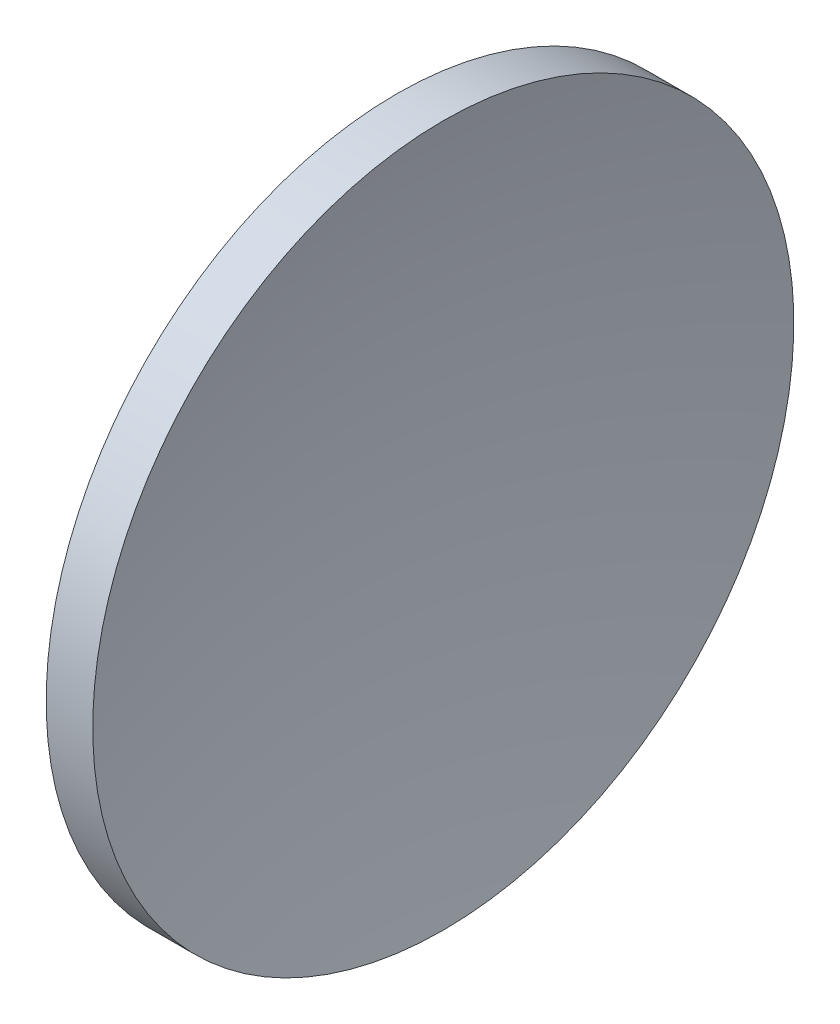
ISO-10303-21;
HEADER;
FILE_DESCRIPTION(('STEP AP214'),'2;1');
FILE_NAME('part.step','',(''),(''),'','','');
FILE_SCHEMA(('AUTOMOTIVE_DESIGN { 1 0 10303 214 1 1 1 1 }'));
ENDSEC;
DATA;
#1=APPLICATION_CONTEXT('core data for automotive mechanical design processes');
#2=APPLICATION_PROTOCOL_DEFINITION('international standard','automotive_design',2000,#1);
#3=PRODUCT_CONTEXT('',#1,'mechanical');
#4=PRODUCT('Part','Part','',(#3));
#5=PRODUCT_RELATED_PRODUCT_CATEGORY('part','',(#4));
#6=PRODUCT_DEFINITION_FORMATION('','',#4);
#7=PRODUCT_DEFINITION_CONTEXT('part definition',#1,'design');
#8=PRODUCT_DEFINITION('design','',#6,#7);
#9=PRODUCT_DEFINITION_SHAPE('','',#8);
#10=(LENGTH_UNIT() NAMED_UNIT(*) SI_UNIT(.MILLI.,.METRE.));
#11=(NAMED_UNIT(*) PLANE_ANGLE_UNIT() SI_UNIT($,.RADIAN.));
#12=(NAMED_UNIT(*) SI_UNIT($,.STERADIAN.) SOLID_ANGLE_UNIT());
#13=UNCERTAINTY_MEASURE_WITH_UNIT(LENGTH_MEASURE(1.E-05),#10,'distance_accuracy_value','');
#14=(GEOMETRIC_REPRESENTATION_CONTEXT(3) GLOBAL_UNCERTAINTY_ASSIGNED_CONTEXT((#13)) GLOBAL_UNIT_ASSIGNED_CONTEXT((#10,
#11,#12)) REPRESENTATION_CONTEXT('',''));
#15=CARTESIAN_POINT('',(0.,0.,0.));
#16=DIRECTION('',(0.,0.,1.));
#17=DIRECTION('',(1.,0.,0.));
#18=AXIS2_PLACEMENT_3D('',#15,#16,#17);
#19=CARTESIAN_POINT('',(155.999497835874,65.2168404709403,0.));
#20=DIRECTION('',(-1.,0.,0.));
#21=DIRECTION('',(0.,1.,0.));
#22=AXIS2_PLACEMENT_3D('',#19,#20,#21);
#23=SPHERICAL_SURFACE('',#22,33.4);
#24=CARTESIAN_POINT('',(125.026767894844,65.2168404709403,0.));
#25=DIRECTION('',(-1.,0.,0.));
#26=DIRECTION('',(0.,-1.,0.));
#27=AXIS2_PLACEMENT_3D('',#24,#25,#26);
#28=CIRCLE('',#27,12.5);
#29=CARTESIAN_POINT('',(125.026767894844,52.7168404709403,0.));
#30=VERTEX_POINT('',#29);
#31=EDGE_CURVE('E41',#30,#30,#28,.T.);
#32=ORIENTED_EDGE('',*,*,#31,.T.);
#33=EDGE_LOOP('',(#32));
#34=FACE_BOUND('',#33,.T.);
#35=ADVANCED_FACE('F35',(#34),#23,.T.);
#36=CARTESIAN_POINT('',(175.099497835874,65.2168404709403,0.));
#37=DIRECTION('',(-1.,0.,0.));
#38=DIRECTION('',(0.,1.,0.));
#39=AXIS2_PLACEMENT_3D('',#36,#37,#38);
#40=SPHERICAL_SURFACE('',#39,50.);
#41=CARTESIAN_POINT('',(126.687206008282,65.2168404709403,0.));
#42=DIRECTION('',(-1.,0.,0.));
#43=DIRECTION('',(0.,-1.,0.));
#44=AXIS2_PLACEMENT_3D('',#41,#42,#43);
#45=CIRCLE('',#44,12.5);
#46=CARTESIAN_POINT('',(126.687206008282,52.7168404709403,0.));
#47=VERTEX_POINT('',#46);
#48=EDGE_CURVE('E10',#47,#47,#45,.T.);
#49=ORIENTED_EDGE('',*,*,#48,.F.);
#50=EDGE_LOOP('',(#49));
#51=FACE_BOUND('',#50,.T.);
#52=ADVANCED_FACE('F50',(#51),#40,.F.);
#53=CARTESIAN_POINT('',(115.944491297963,65.2168404709403,0.));
#54=DIRECTION('',(-1.,0.,0.));
#55=DIRECTION('',(0.,-1.,0.));
#56=AXIS2_PLACEMENT_3D('',#53,#54,#55);
#57=CYLINDRICAL_SURFACE('',#56,12.5);
#58=ORIENTED_EDGE('',*,*,#31,.F.);
#59=EDGE_LOOP('',(#58));
#60=FACE_BOUND('',#59,.T.);
#61=ORIENTED_EDGE('',*,*,#48,.T.);
#62=EDGE_LOOP('',(#61));
#63=FACE_BOUND('',#62,.T.);
#64=ADVANCED_FACE('F48',(#60,#63),#57,.T.);
#65=CLOSED_SHELL('',(#35,#52,#64));
#66=MANIFOLD_SOLID_BREP('B2',#65);
#67=ADVANCED_BREP_SHAPE_REPRESENTATION('',(#18,#66),#14);
#68=SHAPE_DEFINITION_REPRESENTATION(#9,#67);
ENDSEC;
END-ISO-10303-21;
